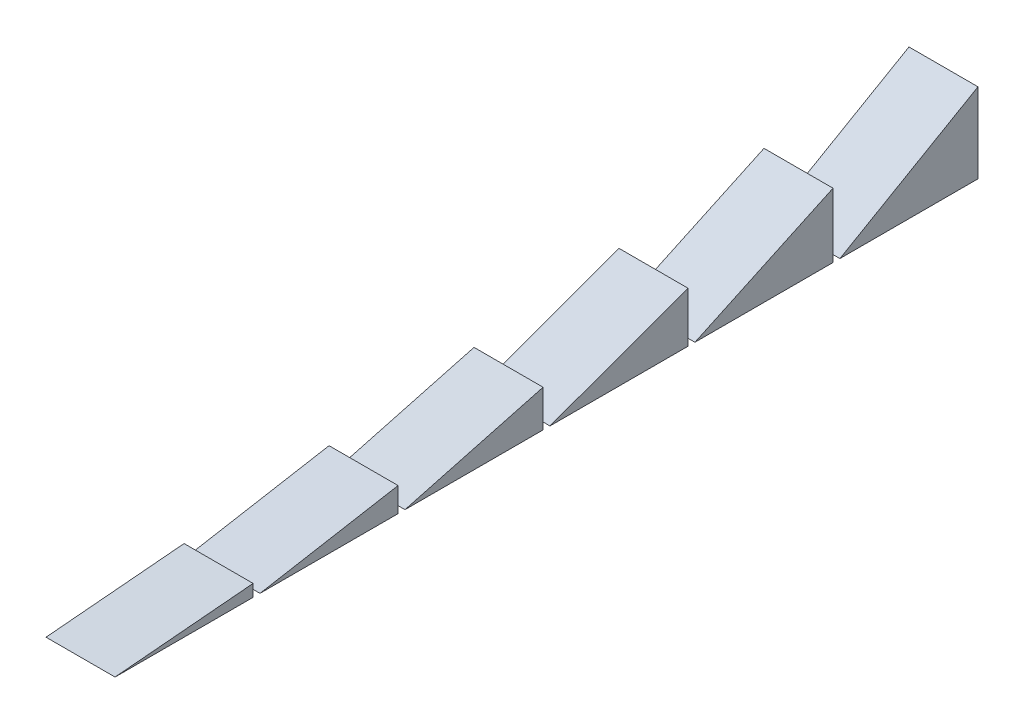
ISO-10303-21;
HEADER;
FILE_DESCRIPTION(('STEP AP214'),'2;1');
FILE_NAME('part.step','',(''),(''),'','','');
FILE_SCHEMA(('AUTOMOTIVE_DESIGN { 1 0 10303 214 1 1 1 1 }'));
ENDSEC;
DATA;
#1=APPLICATION_CONTEXT('core data for automotive mechanical design processes');
#2=APPLICATION_PROTOCOL_DEFINITION('international standard','automotive_design',2000,#1);
#3=PRODUCT_CONTEXT('',#1,'mechanical');
#4=PRODUCT('Part','Part','',(#3));
#5=PRODUCT_RELATED_PRODUCT_CATEGORY('part','',(#4));
#6=PRODUCT_DEFINITION_FORMATION('','',#4);
#7=PRODUCT_DEFINITION_CONTEXT('part definition',#1,'design');
#8=PRODUCT_DEFINITION('design','',#6,#7);
#9=PRODUCT_DEFINITION_SHAPE('','',#8);
#10=(LENGTH_UNIT() NAMED_UNIT(*) SI_UNIT(.MILLI.,.METRE.));
#11=(NAMED_UNIT(*) PLANE_ANGLE_UNIT() SI_UNIT($,.RADIAN.));
#12=(NAMED_UNIT(*) SI_UNIT($,.STERADIAN.) SOLID_ANGLE_UNIT());
#13=UNCERTAINTY_MEASURE_WITH_UNIT(LENGTH_MEASURE(1.E-05),#10,'distance_accuracy_value','');
#14=(GEOMETRIC_REPRESENTATION_CONTEXT(3) GLOBAL_UNCERTAINTY_ASSIGNED_CONTEXT((#13)) GLOBAL_UNIT_ASSIGNED_CONTEXT((#10,
#11,#12)) REPRESENTATION_CONTEXT('',''));
#15=CARTESIAN_POINT('',(0.,0.,0.));
#16=DIRECTION('',(0.,0.,1.));
#17=DIRECTION('',(1.,0.,0.));
#18=AXIS2_PLACEMENT_3D('',#15,#16,#17);
#19=CARTESIAN_POINT('',(25.4,29.3293936748326,-317.5));
#20=DIRECTION('',(0.,-0.866025403784442,-0.499999999999995));
#21=DIRECTION('',(0.,0.499999999999995,-0.866025403784442));
#22=AXIS2_PLACEMENT_3D('',#19,#20,#21);
#23=PLANE('',#22);
#24=DIRECTION('',(0.,-0.499999999999995,0.866025403784442));
#25=VECTOR('',#24,1.);
#26=CARTESIAN_POINT('',(0.,29.3293936748326,-317.5));
#27=LINE('',#26,#25);
#28=CARTESIAN_POINT('',(0.,29.3293936748326,-317.5));
#29=VERTEX_POINT('',#28);
#30=CARTESIAN_POINT('',(0.,0.,-266.7));
#31=VERTEX_POINT('',#30);
#32=EDGE_CURVE('E90',#29,#31,#27,.T.);
#33=ORIENTED_EDGE('',*,*,#32,.T.);
#34=DIRECTION('',(-1.,0.,0.));
#35=VECTOR('',#34,1.);
#36=CARTESIAN_POINT('',(25.4,0.,-266.7));
#37=LINE('',#36,#35);
#38=CARTESIAN_POINT('',(25.4,0.,-266.7));
#39=VERTEX_POINT('',#38);
#40=EDGE_CURVE('E12',#39,#31,#37,.T.);
#41=ORIENTED_EDGE('',*,*,#40,.F.);
#42=DIRECTION('',(0.,-0.499999999999995,0.866025403784442));
#43=VECTOR('',#42,1.);
#44=CARTESIAN_POINT('',(25.4,29.3293936748326,-317.5));
#45=LINE('',#44,#43);
#46=CARTESIAN_POINT('',(25.4,29.3293936748326,-317.5));
#47=VERTEX_POINT('',#46);
#48=EDGE_CURVE('E83',#47,#39,#45,.T.);
#49=ORIENTED_EDGE('',*,*,#48,.F.);
#50=DIRECTION('',(-1.,0.,0.));
#51=VECTOR('',#50,1.);
#52=CARTESIAN_POINT('',(25.4,29.3293936748326,-317.5));
#53=LINE('',#52,#51);
#54=EDGE_CURVE('E91',#47,#29,#53,.T.);
#55=ORIENTED_EDGE('',*,*,#54,.T.);
#56=EDGE_LOOP('',(#33,#41,#49,#55));
#57=FACE_BOUND('',#56,.T.);
#58=ADVANCED_FACE('F43',(#57),#23,.F.);
#59=CARTESIAN_POINT('',(25.4,0.,-266.7));
#60=DIRECTION('',(0.,1.,0.));
#61=DIRECTION('',(0.,0.,1.));
#62=AXIS2_PLACEMENT_3D('',#59,#60,#61);
#63=PLANE('',#62);
#64=DIRECTION('',(0.,0.,-1.));
#65=VECTOR('',#64,1.);
#66=CARTESIAN_POINT('',(0.,0.,-266.7));
#67=LINE('',#66,#65);
#68=CARTESIAN_POINT('',(0.,0.,-317.5));
#69=VERTEX_POINT('',#68);
#70=EDGE_CURVE('E71',#31,#69,#67,.T.);
#71=ORIENTED_EDGE('',*,*,#70,.T.);
#72=DIRECTION('',(-1.,0.,0.));
#73=VECTOR('',#72,1.);
#74=CARTESIAN_POINT('',(25.4,0.,-317.5));
#75=LINE('',#74,#73);
#76=CARTESIAN_POINT('',(25.4,0.,-317.5));
#77=VERTEX_POINT('',#76);
#78=EDGE_CURVE('E51',#77,#69,#75,.T.);
#79=ORIENTED_EDGE('',*,*,#78,.F.);
#80=DIRECTION('',(0.,0.,-1.));
#81=VECTOR('',#80,1.);
#82=CARTESIAN_POINT('',(25.4,0.,-266.7));
#83=LINE('',#82,#81);
#84=EDGE_CURVE('E79',#39,#77,#83,.T.);
#85=ORIENTED_EDGE('',*,*,#84,.F.);
#86=ORIENTED_EDGE('',*,*,#40,.T.);
#87=EDGE_LOOP('',(#71,#79,#85,#86));
#88=FACE_BOUND('',#87,.T.);
#89=ADVANCED_FACE('F80',(#88),#63,.F.);
#90=CARTESIAN_POINT('',(25.4,0.,-317.5));
#91=DIRECTION('',(0.,0.,1.));
#92=DIRECTION('',(1.,0.,0.));
#93=AXIS2_PLACEMENT_3D('',#90,#91,#92);
#94=PLANE('',#93);
#95=DIRECTION('',(0.,1.,0.));
#96=VECTOR('',#95,1.);
#97=CARTESIAN_POINT('',(0.,0.,-317.5));
#98=LINE('',#97,#96);
#99=EDGE_CURVE('E76',#69,#29,#98,.T.);
#100=ORIENTED_EDGE('',*,*,#99,.T.);
#101=ORIENTED_EDGE('',*,*,#54,.F.);
#102=DIRECTION('',(0.,1.,0.));
#103=VECTOR('',#102,1.);
#104=CARTESIAN_POINT('',(25.4,0.,-317.5));
#105=LINE('',#104,#103);
#106=EDGE_CURVE('E59',#77,#47,#105,.T.);
#107=ORIENTED_EDGE('',*,*,#106,.F.);
#108=ORIENTED_EDGE('',*,*,#78,.T.);
#109=EDGE_LOOP('',(#100,#101,#107,#108));
#110=FACE_BOUND('',#109,.T.);
#111=ADVANCED_FACE('F98',(#110),#94,.F.);
#112=CARTESIAN_POINT('',(25.4,0.,0.));
#113=DIRECTION('',(-1.,0.,0.));
#114=DIRECTION('',(0.,0.,1.));
#115=AXIS2_PLACEMENT_3D('',#112,#113,#114);
#116=PLANE('',#115);
#117=ORIENTED_EDGE('',*,*,#48,.T.);
#118=ORIENTED_EDGE('',*,*,#84,.T.);
#119=ORIENTED_EDGE('',*,*,#106,.T.);
#120=EDGE_LOOP('',(#117,#118,#119));
#121=FACE_BOUND('',#120,.T.);
#122=ADVANCED_FACE('F86',(#121),#116,.F.);
#123=CARTESIAN_POINT('',(0.,0.,0.));
#124=DIRECTION('',(-1.,0.,0.));
#125=DIRECTION('',(0.,0.,1.));
#126=AXIS2_PLACEMENT_3D('',#123,#124,#125);
#127=PLANE('',#126);
#128=ORIENTED_EDGE('',*,*,#32,.F.);
#129=ORIENTED_EDGE('',*,*,#99,.F.);
#130=ORIENTED_EDGE('',*,*,#70,.F.);
#131=EDGE_LOOP('',(#128,#129,#130));
#132=FACE_BOUND('',#131,.T.);
#133=ADVANCED_FACE('F99',(#132),#127,.T.);
#134=CLOSED_SHELL('',(#58,#89,#111,#122,#133));
#135=MANIFOLD_SOLID_BREP('B2',#134);
#136=CARTESIAN_POINT('',(25.4,23.6884290342736,-264.16));
#137=DIRECTION('',(0.,-0.906307787036652,-0.422618261740694));
#138=DIRECTION('',(0.,0.422618261740694,-0.906307787036653));
#139=AXIS2_PLACEMENT_3D('',#136,#137,#138);
#140=PLANE('',#139);
#141=DIRECTION('',(0.,-0.422618261740694,0.906307787036652));
#142=VECTOR('',#141,1.);
#143=CARTESIAN_POINT('',(0.,23.6884290342736,-264.16));
#144=LINE('',#143,#142);
#145=CARTESIAN_POINT('',(0.,23.6884290342736,-264.16));
#146=VERTEX_POINT('',#145);
#147=CARTESIAN_POINT('',(0.,0.,-213.36));
#148=VERTEX_POINT('',#147);
#149=EDGE_CURVE('E197',#146,#148,#144,.T.);
#150=ORIENTED_EDGE('',*,*,#149,.T.);
#151=DIRECTION('',(-1.,0.,0.));
#152=VECTOR('',#151,1.);
#153=CARTESIAN_POINT('',(25.4,0.,-213.36));
#154=LINE('',#153,#152);
#155=CARTESIAN_POINT('',(25.4,0.,-213.36));
#156=VERTEX_POINT('',#155);
#157=EDGE_CURVE('E41',#156,#148,#154,.T.);
#158=ORIENTED_EDGE('',*,*,#157,.F.);
#159=DIRECTION('',(0.,-0.422618261740694,0.906307787036652));
#160=VECTOR('',#159,1.);
#161=CARTESIAN_POINT('',(25.4,23.6884290342736,-264.16));
#162=LINE('',#161,#160);
#163=CARTESIAN_POINT('',(25.4,23.6884290342736,-264.16));
#164=VERTEX_POINT('',#163);
#165=EDGE_CURVE('E190',#164,#156,#162,.T.);
#166=ORIENTED_EDGE('',*,*,#165,.F.);
#167=DIRECTION('',(-1.,0.,0.));
#168=VECTOR('',#167,1.);
#169=CARTESIAN_POINT('',(25.4,23.6884290342736,-264.16));
#170=LINE('',#169,#168);
#171=EDGE_CURVE('E198',#164,#146,#170,.T.);
#172=ORIENTED_EDGE('',*,*,#171,.T.);
#173=EDGE_LOOP('',(#150,#158,#166,#172));
#174=FACE_BOUND('',#173,.T.);
#175=ADVANCED_FACE('F150',(#174),#140,.F.);
#176=CARTESIAN_POINT('',(25.4,0.,-213.36));
#177=DIRECTION('',(0.,1.,0.));
#178=DIRECTION('',(0.,0.,1.));
#179=AXIS2_PLACEMENT_3D('',#176,#177,#178);
#180=PLANE('',#179);
#181=DIRECTION('',(0.,0.,-1.));
#182=VECTOR('',#181,1.);
#183=CARTESIAN_POINT('',(0.,0.,-213.36));
#184=LINE('',#183,#182);
#185=CARTESIAN_POINT('',(0.,0.,-264.16));
#186=VERTEX_POINT('',#185);
#187=EDGE_CURVE('E178',#148,#186,#184,.T.);
#188=ORIENTED_EDGE('',*,*,#187,.T.);
#189=DIRECTION('',(-1.,0.,0.));
#190=VECTOR('',#189,1.);
#191=CARTESIAN_POINT('',(25.4,0.,-264.16));
#192=LINE('',#191,#190);
#193=CARTESIAN_POINT('',(25.4,0.,-264.16));
#194=VERTEX_POINT('',#193);
#195=EDGE_CURVE('E158',#194,#186,#192,.T.);
#196=ORIENTED_EDGE('',*,*,#195,.F.);
#197=DIRECTION('',(0.,0.,-1.));
#198=VECTOR('',#197,1.);
#199=CARTESIAN_POINT('',(25.4,0.,-213.36));
#200=LINE('',#199,#198);
#201=EDGE_CURVE('E186',#156,#194,#200,.T.);
#202=ORIENTED_EDGE('',*,*,#201,.F.);
#203=ORIENTED_EDGE('',*,*,#157,.T.);
#204=EDGE_LOOP('',(#188,#196,#202,#203));
#205=FACE_BOUND('',#204,.T.);
#206=ADVANCED_FACE('F187',(#205),#180,.F.);
#207=CARTESIAN_POINT('',(25.4,0.,-264.16));
#208=DIRECTION('',(0.,0.,1.));
#209=DIRECTION('',(1.,0.,0.));
#210=AXIS2_PLACEMENT_3D('',#207,#208,#209);
#211=PLANE('',#210);
#212=DIRECTION('',(0.,1.,0.));
#213=VECTOR('',#212,1.);
#214=CARTESIAN_POINT('',(0.,0.,-264.16));
#215=LINE('',#214,#213);
#216=EDGE_CURVE('E183',#186,#146,#215,.T.);
#217=ORIENTED_EDGE('',*,*,#216,.T.);
#218=ORIENTED_EDGE('',*,*,#171,.F.);
#219=DIRECTION('',(0.,1.,0.));
#220=VECTOR('',#219,1.);
#221=CARTESIAN_POINT('',(25.4,0.,-264.16));
#222=LINE('',#221,#220);
#223=EDGE_CURVE('E166',#194,#164,#222,.T.);
#224=ORIENTED_EDGE('',*,*,#223,.F.);
#225=ORIENTED_EDGE('',*,*,#195,.T.);
#226=EDGE_LOOP('',(#217,#218,#224,#225));
#227=FACE_BOUND('',#226,.T.);
#228=ADVANCED_FACE('F205',(#227),#211,.F.);
#229=CARTESIAN_POINT('',(25.4,0.,0.));
#230=DIRECTION('',(-1.,0.,0.));
#231=DIRECTION('',(0.,0.,1.));
#232=AXIS2_PLACEMENT_3D('',#229,#230,#231);
#233=PLANE('',#232);
#234=ORIENTED_EDGE('',*,*,#165,.T.);
#235=ORIENTED_EDGE('',*,*,#201,.T.);
#236=ORIENTED_EDGE('',*,*,#223,.T.);
#237=EDGE_LOOP('',(#234,#235,#236));
#238=FACE_BOUND('',#237,.T.);
#239=ADVANCED_FACE('F193',(#238),#233,.F.);
#240=CARTESIAN_POINT('',(0.,0.,0.));
#241=DIRECTION('',(-1.,0.,0.));
#242=DIRECTION('',(0.,0.,1.));
#243=AXIS2_PLACEMENT_3D('',#240,#241,#242);
#244=PLANE('',#243);
#245=ORIENTED_EDGE('',*,*,#149,.F.);
#246=ORIENTED_EDGE('',*,*,#216,.F.);
#247=ORIENTED_EDGE('',*,*,#187,.F.);
#248=EDGE_LOOP('',(#245,#246,#247));
#249=FACE_BOUND('',#248,.T.);
#250=ADVANCED_FACE('F206',(#249),#244,.T.);
#251=CLOSED_SHELL('',(#175,#206,#228,#239,#250));
#252=MANIFOLD_SOLID_BREP('B6',#251);
#253=CARTESIAN_POINT('',(25.4,18.4896879007227,-210.82));
#254=DIRECTION('',(0.,-0.93969262078591,-0.342020143325663));
#255=DIRECTION('',(0.,0.342020143325663,-0.939692620785911));
#256=AXIS2_PLACEMENT_3D('',#253,#254,#255);
#257=PLANE('',#256);
#258=DIRECTION('',(0.,-0.342020143325663,0.93969262078591));
#259=VECTOR('',#258,1.);
#260=CARTESIAN_POINT('',(0.,18.4896879007227,-210.82));
#261=LINE('',#260,#259);
#262=CARTESIAN_POINT('',(0.,18.4896879007227,-210.82));
#263=VERTEX_POINT('',#262);
#264=CARTESIAN_POINT('',(0.,0.,-160.02));
#265=VERTEX_POINT('',#264);
#266=EDGE_CURVE('E304',#263,#265,#261,.T.);
#267=ORIENTED_EDGE('',*,*,#266,.T.);
#268=DIRECTION('',(-1.,0.,0.));
#269=VECTOR('',#268,1.);
#270=CARTESIAN_POINT('',(25.4,0.,-160.02));
#271=LINE('',#270,#269);
#272=CARTESIAN_POINT('',(25.4,0.,-160.02));
#273=VERTEX_POINT('',#272);
#274=EDGE_CURVE('E148',#273,#265,#271,.T.);
#275=ORIENTED_EDGE('',*,*,#274,.F.);
#276=DIRECTION('',(0.,-0.342020143325663,0.93969262078591));
#277=VECTOR('',#276,1.);
#278=CARTESIAN_POINT('',(25.4,18.4896879007227,-210.82));
#279=LINE('',#278,#277);
#280=CARTESIAN_POINT('',(25.4,18.4896879007227,-210.82));
#281=VERTEX_POINT('',#280);
#282=EDGE_CURVE('E297',#281,#273,#279,.T.);
#283=ORIENTED_EDGE('',*,*,#282,.F.);
#284=DIRECTION('',(-1.,0.,0.));
#285=VECTOR('',#284,1.);
#286=CARTESIAN_POINT('',(25.4,18.4896879007227,-210.82));
#287=LINE('',#286,#285);
#288=EDGE_CURVE('E305',#281,#263,#287,.T.);
#289=ORIENTED_EDGE('',*,*,#288,.T.);
#290=EDGE_LOOP('',(#267,#275,#283,#289));
#291=FACE_BOUND('',#290,.T.);
#292=ADVANCED_FACE('F257',(#291),#257,.F.);
#293=CARTESIAN_POINT('',(25.4,0.,-160.02));
#294=DIRECTION('',(0.,1.,0.));
#295=DIRECTION('',(0.,0.,1.));
#296=AXIS2_PLACEMENT_3D('',#293,#294,#295);
#297=PLANE('',#296);
#298=DIRECTION('',(0.,0.,-1.));
#299=VECTOR('',#298,1.);
#300=CARTESIAN_POINT('',(0.,0.,-160.02));
#301=LINE('',#300,#299);
#302=CARTESIAN_POINT('',(0.,0.,-210.82));
#303=VERTEX_POINT('',#302);
#304=EDGE_CURVE('E285',#265,#303,#301,.T.);
#305=ORIENTED_EDGE('',*,*,#304,.T.);
#306=DIRECTION('',(-1.,0.,0.));
#307=VECTOR('',#306,1.);
#308=CARTESIAN_POINT('',(25.4,0.,-210.82));
#309=LINE('',#308,#307);
#310=CARTESIAN_POINT('',(25.4,0.,-210.82));
#311=VERTEX_POINT('',#310);
#312=EDGE_CURVE('E265',#311,#303,#309,.T.);
#313=ORIENTED_EDGE('',*,*,#312,.F.);
#314=DIRECTION('',(0.,0.,-1.));
#315=VECTOR('',#314,1.);
#316=CARTESIAN_POINT('',(25.4,0.,-160.02));
#317=LINE('',#316,#315);
#318=EDGE_CURVE('E293',#273,#311,#317,.T.);
#319=ORIENTED_EDGE('',*,*,#318,.F.);
#320=ORIENTED_EDGE('',*,*,#274,.T.);
#321=EDGE_LOOP('',(#305,#313,#319,#320));
#322=FACE_BOUND('',#321,.T.);
#323=ADVANCED_FACE('F294',(#322),#297,.F.);
#324=CARTESIAN_POINT('',(25.4,0.,-210.82));
#325=DIRECTION('',(0.,0.,1.));
#326=DIRECTION('',(1.,0.,0.));
#327=AXIS2_PLACEMENT_3D('',#324,#325,#326);
#328=PLANE('',#327);
#329=DIRECTION('',(0.,1.,0.));
#330=VECTOR('',#329,1.);
#331=CARTESIAN_POINT('',(0.,0.,-210.82));
#332=LINE('',#331,#330);
#333=EDGE_CURVE('E290',#303,#263,#332,.T.);
#334=ORIENTED_EDGE('',*,*,#333,.T.);
#335=ORIENTED_EDGE('',*,*,#288,.F.);
#336=DIRECTION('',(0.,1.,0.));
#337=VECTOR('',#336,1.);
#338=CARTESIAN_POINT('',(25.4,0.,-210.82));
#339=LINE('',#338,#337);
#340=EDGE_CURVE('E273',#311,#281,#339,.T.);
#341=ORIENTED_EDGE('',*,*,#340,.F.);
#342=ORIENTED_EDGE('',*,*,#312,.T.);
#343=EDGE_LOOP('',(#334,#335,#341,#342));
#344=FACE_BOUND('',#343,.T.);
#345=ADVANCED_FACE('F312',(#344),#328,.F.);
#346=CARTESIAN_POINT('',(25.4,0.,0.));
#347=DIRECTION('',(-1.,0.,0.));
#348=DIRECTION('',(0.,0.,1.));
#349=AXIS2_PLACEMENT_3D('',#346,#347,#348);
#350=PLANE('',#349);
#351=ORIENTED_EDGE('',*,*,#282,.T.);
#352=ORIENTED_EDGE('',*,*,#318,.T.);
#353=ORIENTED_EDGE('',*,*,#340,.T.);
#354=EDGE_LOOP('',(#351,#352,#353));
#355=FACE_BOUND('',#354,.T.);
#356=ADVANCED_FACE('F300',(#355),#350,.F.);
#357=CARTESIAN_POINT('',(0.,0.,0.));
#358=DIRECTION('',(-1.,0.,0.));
#359=DIRECTION('',(0.,0.,1.));
#360=AXIS2_PLACEMENT_3D('',#357,#358,#359);
#361=PLANE('',#360);
#362=ORIENTED_EDGE('',*,*,#266,.F.);
#363=ORIENTED_EDGE('',*,*,#333,.F.);
#364=ORIENTED_EDGE('',*,*,#304,.F.);
#365=EDGE_LOOP('',(#362,#363,#364));
#366=FACE_BOUND('',#365,.T.);
#367=ADVANCED_FACE('F313',(#366),#361,.T.);
#368=CLOSED_SHELL('',(#292,#323,#345,#356,#367));
#369=MANIFOLD_SOLID_BREP('B35',#368);
#370=CARTESIAN_POINT('',(25.4,13.6118189755007,-157.48));
#371=DIRECTION('',(0.,-0.96592582628907,-0.258819045102515));
#372=DIRECTION('',(0.,0.258819045102515,-0.96592582628907));
#373=AXIS2_PLACEMENT_3D('',#370,#371,#372);
#374=PLANE('',#373);
#375=DIRECTION('',(0.,-0.258819045102515,0.96592582628907));
#376=VECTOR('',#375,1.);
#377=CARTESIAN_POINT('',(0.,13.6118189755007,-157.48));
#378=LINE('',#377,#376);
#379=CARTESIAN_POINT('',(0.,13.6118189755007,-157.48));
#380=VERTEX_POINT('',#379);
#381=CARTESIAN_POINT('',(0.,0.,-106.68));
#382=VERTEX_POINT('',#381);
#383=EDGE_CURVE('E411',#380,#382,#378,.T.);
#384=ORIENTED_EDGE('',*,*,#383,.T.);
#385=DIRECTION('',(-1.,0.,0.));
#386=VECTOR('',#385,1.);
#387=CARTESIAN_POINT('',(25.4,0.,-106.68));
#388=LINE('',#387,#386);
#389=CARTESIAN_POINT('',(25.4,0.,-106.68));
#390=VERTEX_POINT('',#389);
#391=EDGE_CURVE('E255',#390,#382,#388,.T.);
#392=ORIENTED_EDGE('',*,*,#391,.F.);
#393=DIRECTION('',(0.,-0.258819045102515,0.96592582628907));
#394=VECTOR('',#393,1.);
#395=CARTESIAN_POINT('',(25.4,13.6118189755007,-157.48));
#396=LINE('',#395,#394);
#397=CARTESIAN_POINT('',(25.4,13.6118189755007,-157.48));
#398=VERTEX_POINT('',#397);
#399=EDGE_CURVE('E404',#398,#390,#396,.T.);
#400=ORIENTED_EDGE('',*,*,#399,.F.);
#401=DIRECTION('',(-1.,0.,0.));
#402=VECTOR('',#401,1.);
#403=CARTESIAN_POINT('',(25.4,13.6118189755007,-157.48));
#404=LINE('',#403,#402);
#405=EDGE_CURVE('E412',#398,#380,#404,.T.);
#406=ORIENTED_EDGE('',*,*,#405,.T.);
#407=EDGE_LOOP('',(#384,#392,#400,#406));
#408=FACE_BOUND('',#407,.T.);
#409=ADVANCED_FACE('F364',(#408),#374,.F.);
#410=CARTESIAN_POINT('',(25.4,0.,-106.68));
#411=DIRECTION('',(0.,1.,0.));
#412=DIRECTION('',(0.,0.,1.));
#413=AXIS2_PLACEMENT_3D('',#410,#411,#412);
#414=PLANE('',#413);
#415=DIRECTION('',(0.,0.,-1.));
#416=VECTOR('',#415,1.);
#417=CARTESIAN_POINT('',(0.,0.,-106.68));
#418=LINE('',#417,#416);
#419=CARTESIAN_POINT('',(0.,0.,-157.48));
#420=VERTEX_POINT('',#419);
#421=EDGE_CURVE('E392',#382,#420,#418,.T.);
#422=ORIENTED_EDGE('',*,*,#421,.T.);
#423=DIRECTION('',(-1.,0.,0.));
#424=VECTOR('',#423,1.);
#425=CARTESIAN_POINT('',(25.4,0.,-157.48));
#426=LINE('',#425,#424);
#427=CARTESIAN_POINT('',(25.4,0.,-157.48));
#428=VERTEX_POINT('',#427);
#429=EDGE_CURVE('E372',#428,#420,#426,.T.);
#430=ORIENTED_EDGE('',*,*,#429,.F.);
#431=DIRECTION('',(0.,0.,-1.));
#432=VECTOR('',#431,1.);
#433=CARTESIAN_POINT('',(25.4,0.,-106.68));
#434=LINE('',#433,#432);
#435=EDGE_CURVE('E400',#390,#428,#434,.T.);
#436=ORIENTED_EDGE('',*,*,#435,.F.);
#437=ORIENTED_EDGE('',*,*,#391,.T.);
#438=EDGE_LOOP('',(#422,#430,#436,#437));
#439=FACE_BOUND('',#438,.T.);
#440=ADVANCED_FACE('F401',(#439),#414,.F.);
#441=CARTESIAN_POINT('',(25.4,0.,-157.48));
#442=DIRECTION('',(0.,0.,1.));
#443=DIRECTION('',(1.,0.,0.));
#444=AXIS2_PLACEMENT_3D('',#441,#442,#443);
#445=PLANE('',#444);
#446=DIRECTION('',(0.,1.,0.));
#447=VECTOR('',#446,1.);
#448=CARTESIAN_POINT('',(0.,0.,-157.48));
#449=LINE('',#448,#447);
#450=EDGE_CURVE('E397',#420,#380,#449,.T.);
#451=ORIENTED_EDGE('',*,*,#450,.T.);
#452=ORIENTED_EDGE('',*,*,#405,.F.);
#453=DIRECTION('',(0.,1.,0.));
#454=VECTOR('',#453,1.);
#455=CARTESIAN_POINT('',(25.4,0.,-157.48));
#456=LINE('',#455,#454);
#457=EDGE_CURVE('E380',#428,#398,#456,.T.);
#458=ORIENTED_EDGE('',*,*,#457,.F.);
#459=ORIENTED_EDGE('',*,*,#429,.T.);
#460=EDGE_LOOP('',(#451,#452,#458,#459));
#461=FACE_BOUND('',#460,.T.);
#462=ADVANCED_FACE('F419',(#461),#445,.F.);
#463=CARTESIAN_POINT('',(25.4,0.,0.));
#464=DIRECTION('',(-1.,0.,0.));
#465=DIRECTION('',(0.,0.,1.));
#466=AXIS2_PLACEMENT_3D('',#463,#464,#465);
#467=PLANE('',#466);
#468=ORIENTED_EDGE('',*,*,#399,.T.);
#469=ORIENTED_EDGE('',*,*,#435,.T.);
#470=ORIENTED_EDGE('',*,*,#457,.T.);
#471=EDGE_LOOP('',(#468,#469,#470));
#472=FACE_BOUND('',#471,.T.);
#473=ADVANCED_FACE('F407',(#472),#467,.F.);
#474=CARTESIAN_POINT('',(0.,0.,0.));
#475=DIRECTION('',(-1.,0.,0.));
#476=DIRECTION('',(0.,0.,1.));
#477=AXIS2_PLACEMENT_3D('',#474,#475,#476);
#478=PLANE('',#477);
#479=ORIENTED_EDGE('',*,*,#383,.F.);
#480=ORIENTED_EDGE('',*,*,#450,.F.);
#481=ORIENTED_EDGE('',*,*,#421,.F.);
#482=EDGE_LOOP('',(#479,#480,#481));
#483=FACE_BOUND('',#482,.T.);
#484=ADVANCED_FACE('F420',(#483),#478,.T.);
#485=CLOSED_SHELL('',(#409,#440,#462,#473,#484));
#486=MANIFOLD_SOLID_BREP('B142',#485);
#487=CARTESIAN_POINT('',(25.4,8.95741061998967,-104.14));
#488=DIRECTION('',(0.,-0.984807753012209,-0.173648177666924));
#489=DIRECTION('',(0.,0.173648177666924,-0.984807753012209));
#490=AXIS2_PLACEMENT_3D('',#487,#488,#489);
#491=PLANE('',#490);
#492=DIRECTION('',(0.,-0.173648177666924,0.984807753012209));
#493=VECTOR('',#492,1.);
#494=CARTESIAN_POINT('',(0.,8.95741061998967,-104.14));
#495=LINE('',#494,#493);
#496=CARTESIAN_POINT('',(0.,8.95741061998967,-104.14));
#497=VERTEX_POINT('',#496);
#498=CARTESIAN_POINT('',(0.,0.,-53.34));
#499=VERTEX_POINT('',#498);
#500=EDGE_CURVE('E517',#497,#499,#495,.T.);
#501=ORIENTED_EDGE('',*,*,#500,.T.);
#502=DIRECTION('',(-1.,0.,0.));
#503=VECTOR('',#502,1.);
#504=CARTESIAN_POINT('',(25.4,0.,-53.34));
#505=LINE('',#504,#503);
#506=CARTESIAN_POINT('',(25.4,0.,-53.34));
#507=VERTEX_POINT('',#506);
#508=EDGE_CURVE('E362',#507,#499,#505,.T.);
#509=ORIENTED_EDGE('',*,*,#508,.F.);
#510=DIRECTION('',(0.,-0.173648177666924,0.984807753012209));
#511=VECTOR('',#510,1.);
#512=CARTESIAN_POINT('',(25.4,8.95741061998967,-104.14));
#513=LINE('',#512,#511);
#514=CARTESIAN_POINT('',(25.4,8.95741061998967,-104.14));
#515=VERTEX_POINT('',#514);
#516=EDGE_CURVE('E510',#515,#507,#513,.T.);
#517=ORIENTED_EDGE('',*,*,#516,.F.);
#518=DIRECTION('',(-1.,0.,0.));
#519=VECTOR('',#518,1.);
#520=CARTESIAN_POINT('',(25.4,8.95741061998967,-104.14));
#521=LINE('',#520,#519);
#522=EDGE_CURVE('E518',#515,#497,#521,.T.);
#523=ORIENTED_EDGE('',*,*,#522,.T.);
#524=EDGE_LOOP('',(#501,#509,#517,#523));
#525=FACE_BOUND('',#524,.T.);
#526=ADVANCED_FACE('F470',(#525),#491,.F.);
#527=CARTESIAN_POINT('',(25.4,0.,-53.34));
#528=DIRECTION('',(0.,1.,0.));
#529=DIRECTION('',(0.,0.,1.));
#530=AXIS2_PLACEMENT_3D('',#527,#528,#529);
#531=PLANE('',#530);
#532=DIRECTION('',(0.,0.,-1.));
#533=VECTOR('',#532,1.);
#534=CARTESIAN_POINT('',(0.,0.,-53.34));
#535=LINE('',#534,#533);
#536=CARTESIAN_POINT('',(0.,0.,-104.14));
#537=VERTEX_POINT('',#536);
#538=EDGE_CURVE('E498',#499,#537,#535,.T.);
#539=ORIENTED_EDGE('',*,*,#538,.T.);
#540=DIRECTION('',(-1.,0.,0.));
#541=VECTOR('',#540,1.);
#542=CARTESIAN_POINT('',(25.4,0.,-104.14));
#543=LINE('',#542,#541);
#544=CARTESIAN_POINT('',(25.4,0.,-104.14));
#545=VERTEX_POINT('',#544);
#546=EDGE_CURVE('E478',#545,#537,#543,.T.);
#547=ORIENTED_EDGE('',*,*,#546,.F.);
#548=DIRECTION('',(0.,0.,-1.));
#549=VECTOR('',#548,1.);
#550=CARTESIAN_POINT('',(25.4,0.,-53.34));
#551=LINE('',#550,#549);
#552=EDGE_CURVE('E506',#507,#545,#551,.T.);
#553=ORIENTED_EDGE('',*,*,#552,.F.);
#554=ORIENTED_EDGE('',*,*,#508,.T.);
#555=EDGE_LOOP('',(#539,#547,#553,#554));
#556=FACE_BOUND('',#555,.T.);
#557=ADVANCED_FACE('F507',(#556),#531,.F.);
#558=CARTESIAN_POINT('',(25.4,0.,-104.14));
#559=DIRECTION('',(0.,0.,1.));
#560=DIRECTION('',(1.,0.,0.));
#561=AXIS2_PLACEMENT_3D('',#558,#559,#560);
#562=PLANE('',#561);
#563=DIRECTION('',(0.,1.,0.));
#564=VECTOR('',#563,1.);
#565=CARTESIAN_POINT('',(0.,0.,-104.14));
#566=LINE('',#565,#564);
#567=EDGE_CURVE('E503',#537,#497,#566,.T.);
#568=ORIENTED_EDGE('',*,*,#567,.T.);
#569=ORIENTED_EDGE('',*,*,#522,.F.);
#570=DIRECTION('',(0.,1.,0.));
#571=VECTOR('',#570,1.);
#572=CARTESIAN_POINT('',(25.4,0.,-104.14));
#573=LINE('',#572,#571);
#574=EDGE_CURVE('E486',#545,#515,#573,.T.);
#575=ORIENTED_EDGE('',*,*,#574,.F.);
#576=ORIENTED_EDGE('',*,*,#546,.T.);
#577=EDGE_LOOP('',(#568,#569,#575,#576));
#578=FACE_BOUND('',#577,.T.);
#579=ADVANCED_FACE('F525',(#578),#562,.F.);
#580=CARTESIAN_POINT('',(25.4,0.,0.));
#581=DIRECTION('',(-1.,0.,0.));
#582=DIRECTION('',(0.,0.,1.));
#583=AXIS2_PLACEMENT_3D('',#580,#581,#582);
#584=PLANE('',#583);
#585=ORIENTED_EDGE('',*,*,#516,.T.);
#586=ORIENTED_EDGE('',*,*,#552,.T.);
#587=ORIENTED_EDGE('',*,*,#574,.T.);
#588=EDGE_LOOP('',(#585,#586,#587));
#589=FACE_BOUND('',#588,.T.);
#590=ADVANCED_FACE('F513',(#589),#584,.F.);
#591=CARTESIAN_POINT('',(0.,0.,0.));
#592=DIRECTION('',(-1.,0.,0.));
#593=DIRECTION('',(0.,0.,1.));
#594=AXIS2_PLACEMENT_3D('',#591,#592,#593);
#595=PLANE('',#594);
#596=ORIENTED_EDGE('',*,*,#500,.F.);
#597=ORIENTED_EDGE('',*,*,#567,.F.);
#598=ORIENTED_EDGE('',*,*,#538,.F.);
#599=EDGE_LOOP('',(#596,#597,#598));
#600=FACE_BOUND('',#599,.T.);
#601=ADVANCED_FACE('F526',(#600),#595,.T.);
#602=CLOSED_SHELL('',(#526,#557,#579,#590,#601));
#603=MANIFOLD_SOLID_BREP('B249',#602);
#604=CARTESIAN_POINT('',(25.4,4.4444241071166,-50.8));
#605=DIRECTION('',(0.,-0.996194698091746,-0.0871557427476516));
#606=DIRECTION('',(0.,0.0871557427476517,-0.996194698091746));
#607=AXIS2_PLACEMENT_3D('',#604,#605,#606);
#608=PLANE('',#607);
#609=DIRECTION('',(0.,-0.0871557427476517,0.996194698091746));
#610=VECTOR('',#609,1.);
#611=CARTESIAN_POINT('',(0.,4.4444241071166,-50.8));
#612=LINE('',#611,#610);
#613=CARTESIAN_POINT('',(0.,4.4444241071166,-50.8));
#614=VERTEX_POINT('',#613);
#615=CARTESIAN_POINT('',(0.,0.,0.));
#616=VERTEX_POINT('',#615);
#617=EDGE_CURVE('E614',#614,#616,#612,.T.);
#618=ORIENTED_EDGE('',*,*,#617,.T.);
#619=DIRECTION('',(-1.,0.,0.));
#620=VECTOR('',#619,1.);
#621=CARTESIAN_POINT('',(25.4,0.,0.));
#622=LINE('',#621,#620);
#623=CARTESIAN_POINT('',(25.4,0.,0.));
#624=VERTEX_POINT('',#623);
#625=EDGE_CURVE('E468',#624,#616,#622,.T.);
#626=ORIENTED_EDGE('',*,*,#625,.F.);
#627=DIRECTION('',(0.,-0.0871557427476517,0.996194698091746));
#628=VECTOR('',#627,1.);
#629=CARTESIAN_POINT('',(25.4,4.4444241071166,-50.8));
#630=LINE('',#629,#628);
#631=CARTESIAN_POINT('',(25.4,4.4444241071166,-50.8));
#632=VERTEX_POINT('',#631);
#633=EDGE_CURVE('E607',#632,#624,#630,.T.);
#634=ORIENTED_EDGE('',*,*,#633,.F.);
#635=DIRECTION('',(-1.,0.,0.));
#636=VECTOR('',#635,1.);
#637=CARTESIAN_POINT('',(25.4,4.4444241071166,-50.8));
#638=LINE('',#637,#636);
#639=EDGE_CURVE('E615',#632,#614,#638,.T.);
#640=ORIENTED_EDGE('',*,*,#639,.T.);
#641=EDGE_LOOP('',(#618,#626,#634,#640));
#642=FACE_BOUND('',#641,.T.);
#643=ADVANCED_FACE('F567',(#642),#608,.F.);
#644=CARTESIAN_POINT('',(25.4,0.,0.));
#645=DIRECTION('',(0.,1.,0.));
#646=DIRECTION('',(0.,0.,1.));
#647=AXIS2_PLACEMENT_3D('',#644,#645,#646);
#648=PLANE('',#647);
#649=DIRECTION('',(0.,0.,-1.));
#650=VECTOR('',#649,1.);
#651=CARTESIAN_POINT('',(0.,0.,0.));
#652=LINE('',#651,#650);
#653=CARTESIAN_POINT('',(0.,0.,-50.8));
#654=VERTEX_POINT('',#653);
#655=EDGE_CURVE('E595',#616,#654,#652,.T.);
#656=ORIENTED_EDGE('',*,*,#655,.T.);
#657=DIRECTION('',(-1.,0.,0.));
#658=VECTOR('',#657,1.);
#659=CARTESIAN_POINT('',(25.4,0.,-50.8));
#660=LINE('',#659,#658);
#661=CARTESIAN_POINT('',(25.4,0.,-50.8));
#662=VERTEX_POINT('',#661);
#663=EDGE_CURVE('E575',#662,#654,#660,.T.);
#664=ORIENTED_EDGE('',*,*,#663,.F.);
#665=DIRECTION('',(0.,0.,-1.));
#666=VECTOR('',#665,1.);
#667=CARTESIAN_POINT('',(25.4,0.,0.));
#668=LINE('',#667,#666);
#669=EDGE_CURVE('E603',#624,#662,#668,.T.);
#670=ORIENTED_EDGE('',*,*,#669,.F.);
#671=ORIENTED_EDGE('',*,*,#625,.T.);
#672=EDGE_LOOP('',(#656,#664,#670,#671));
#673=FACE_BOUND('',#672,.T.);
#674=ADVANCED_FACE('F604',(#673),#648,.F.);
#675=CARTESIAN_POINT('',(25.4,0.,-50.8));
#676=DIRECTION('',(0.,0.,1.));
#677=DIRECTION('',(1.,0.,0.));
#678=AXIS2_PLACEMENT_3D('',#675,#676,#677);
#679=PLANE('',#678);
#680=DIRECTION('',(0.,1.,0.));
#681=VECTOR('',#680,1.);
#682=CARTESIAN_POINT('',(0.,0.,-50.8));
#683=LINE('',#682,#681);
#684=EDGE_CURVE('E600',#654,#614,#683,.T.);
#685=ORIENTED_EDGE('',*,*,#684,.T.);
#686=ORIENTED_EDGE('',*,*,#639,.F.);
#687=DIRECTION('',(0.,1.,0.));
#688=VECTOR('',#687,1.);
#689=CARTESIAN_POINT('',(25.4,0.,-50.8));
#690=LINE('',#689,#688);
#691=EDGE_CURVE('E583',#662,#632,#690,.T.);
#692=ORIENTED_EDGE('',*,*,#691,.F.);
#693=ORIENTED_EDGE('',*,*,#663,.T.);
#694=EDGE_LOOP('',(#685,#686,#692,#693));
#695=FACE_BOUND('',#694,.T.);
#696=ADVANCED_FACE('F622',(#695),#679,.F.);
#697=CARTESIAN_POINT('',(25.4,0.,0.));
#698=DIRECTION('',(-1.,0.,0.));
#699=DIRECTION('',(0.,0.,1.));
#700=AXIS2_PLACEMENT_3D('',#697,#698,#699);
#701=PLANE('',#700);
#702=ORIENTED_EDGE('',*,*,#633,.T.);
#703=ORIENTED_EDGE('',*,*,#669,.T.);
#704=ORIENTED_EDGE('',*,*,#691,.T.);
#705=EDGE_LOOP('',(#702,#703,#704));
#706=FACE_BOUND('',#705,.T.);
#707=ADVANCED_FACE('F610',(#706),#701,.F.);
#708=CARTESIAN_POINT('',(0.,0.,0.));
#709=DIRECTION('',(-1.,0.,0.));
#710=DIRECTION('',(0.,0.,1.));
#711=AXIS2_PLACEMENT_3D('',#708,#709,#710);
#712=PLANE('',#711);
#713=ORIENTED_EDGE('',*,*,#617,.F.);
#714=ORIENTED_EDGE('',*,*,#684,.F.);
#715=ORIENTED_EDGE('',*,*,#655,.F.);
#716=EDGE_LOOP('',(#713,#714,#715));
#717=FACE_BOUND('',#716,.T.);
#718=ADVANCED_FACE('F623',(#717),#712,.T.);
#719=CLOSED_SHELL('',(#643,#674,#696,#707,#718));
#720=MANIFOLD_SOLID_BREP('B356',#719);
#721=ADVANCED_BREP_SHAPE_REPRESENTATION('',(#18,#135,#252,#369,#486,#603,#720),#14);
#722=SHAPE_DEFINITION_REPRESENTATION(#9,#721);
ENDSEC;
END-ISO-10303-21;
